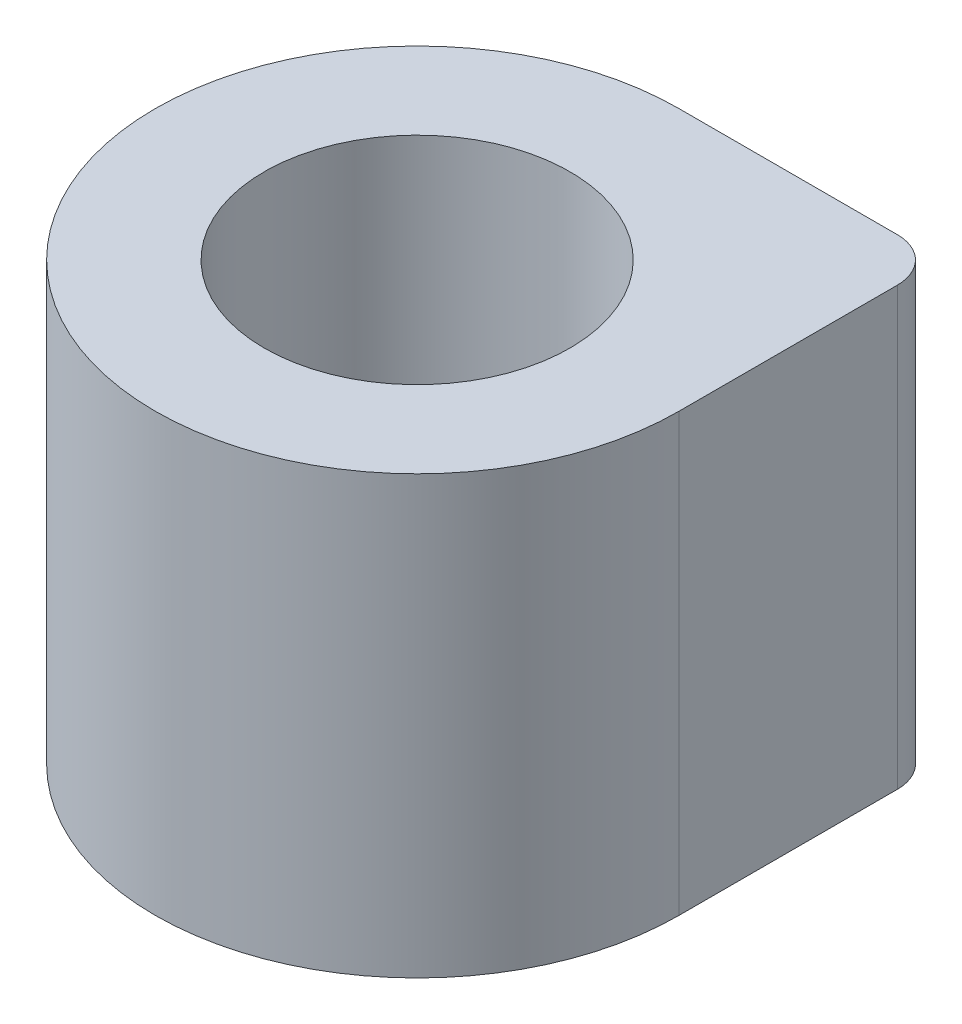
ISO-10303-21;
HEADER;
FILE_DESCRIPTION(('STEP AP214'),'2;1');
FILE_NAME('part.step','',(''),(''),'','','');
FILE_SCHEMA(('AUTOMOTIVE_DESIGN { 1 0 10303 214 1 1 1 1 }'));
ENDSEC;
DATA;
#1=APPLICATION_CONTEXT('core data for automotive mechanical design processes');
#2=APPLICATION_PROTOCOL_DEFINITION('international standard','automotive_design',2000,#1);
#3=PRODUCT_CONTEXT('',#1,'mechanical');
#4=PRODUCT('Part','Part','',(#3));
#5=PRODUCT_RELATED_PRODUCT_CATEGORY('part','',(#4));
#6=PRODUCT_DEFINITION_FORMATION('','',#4);
#7=PRODUCT_DEFINITION_CONTEXT('part definition',#1,'design');
#8=PRODUCT_DEFINITION('design','',#6,#7);
#9=PRODUCT_DEFINITION_SHAPE('','',#8);
#10=(LENGTH_UNIT() NAMED_UNIT(*) SI_UNIT(.MILLI.,.METRE.));
#11=(NAMED_UNIT(*) PLANE_ANGLE_UNIT() SI_UNIT($,.RADIAN.));
#12=(NAMED_UNIT(*) SI_UNIT($,.STERADIAN.) SOLID_ANGLE_UNIT());
#13=UNCERTAINTY_MEASURE_WITH_UNIT(LENGTH_MEASURE(1.E-05),#10,'distance_accuracy_value','');
#14=(GEOMETRIC_REPRESENTATION_CONTEXT(3) GLOBAL_UNCERTAINTY_ASSIGNED_CONTEXT((#13)) GLOBAL_UNIT_ASSIGNED_CONTEXT((#10,
#11,#12)) REPRESENTATION_CONTEXT('',''));
#15=CARTESIAN_POINT('',(0.,0.,0.));
#16=DIRECTION('',(0.,0.,1.));
#17=DIRECTION('',(1.,0.,0.));
#18=AXIS2_PLACEMENT_3D('',#15,#16,#17);
#19=CARTESIAN_POINT('',(0.,10.,0.));
#20=DIRECTION('',(0.,-1.,0.));
#21=DIRECTION('',(0.,0.,-1.));
#22=AXIS2_PLACEMENT_3D('',#19,#20,#21);
#23=CYLINDRICAL_SURFACE('',#22,6.);
#24=CARTESIAN_POINT('',(0.,0.,0.));
#25=DIRECTION('',(0.,1.,0.));
#26=DIRECTION('',(0.,0.,1.));
#27=AXIS2_PLACEMENT_3D('',#24,#25,#26);
#28=CIRCLE('',#27,6.);
#29=CARTESIAN_POINT('',(0.,0.,-6.));
#30=VERTEX_POINT('',#29);
#31=CARTESIAN_POINT('',(6.,0.,0.));
#32=VERTEX_POINT('',#31);
#33=EDGE_CURVE('E90',#30,#32,#28,.T.);
#34=ORIENTED_EDGE('',*,*,#33,.T.);
#35=DIRECTION('',(0.,-1.,0.));
#36=VECTOR('',#35,1.);
#37=CARTESIAN_POINT('',(6.,10.,0.));
#38=LINE('',#37,#36);
#39=CARTESIAN_POINT('',(6.,10.,0.));
#40=VERTEX_POINT('',#39);
#41=EDGE_CURVE('E74',#40,#32,#38,.T.);
#42=ORIENTED_EDGE('',*,*,#41,.F.);
#43=CARTESIAN_POINT('',(0.,10.,0.));
#44=DIRECTION('',(0.,1.,0.));
#45=DIRECTION('',(0.,0.,1.));
#46=AXIS2_PLACEMENT_3D('',#43,#44,#45);
#47=CIRCLE('',#46,6.);
#48=CARTESIAN_POINT('',(0.,10.,-6.));
#49=VERTEX_POINT('',#48);
#50=EDGE_CURVE('E79',#49,#40,#47,.T.);
#51=ORIENTED_EDGE('',*,*,#50,.F.);
#52=DIRECTION('',(0.,-1.,0.));
#53=VECTOR('',#52,1.);
#54=CARTESIAN_POINT('',(0.,10.,-6.));
#55=LINE('',#54,#53);
#56=EDGE_CURVE('E92',#49,#30,#55,.T.);
#57=ORIENTED_EDGE('',*,*,#56,.T.);
#58=EDGE_LOOP('',(#34,#42,#51,#57));
#59=FACE_BOUND('',#58,.T.);
#60=ADVANCED_FACE('F33',(#59),#23,.T.);
#61=CARTESIAN_POINT('',(6.,10.,-6.));
#62=DIRECTION('',(-1.,0.,0.));
#63=DIRECTION('',(0.,0.,1.));
#64=AXIS2_PLACEMENT_3D('',#61,#62,#63);
#65=PLANE('',#64);
#66=DIRECTION('',(0.,0.,-1.));
#67=VECTOR('',#66,1.);
#68=CARTESIAN_POINT('',(6.,0.,-6.));
#69=LINE('',#68,#67);
#70=CARTESIAN_POINT('',(6.,0.,-5.));
#71=VERTEX_POINT('',#70);
#72=EDGE_CURVE('E100',#32,#71,#69,.T.);
#73=ORIENTED_EDGE('',*,*,#72,.T.);
#74=DIRECTION('',(0.,-1.,0.));
#75=VECTOR('',#74,1.);
#76=CARTESIAN_POINT('',(6.,10.,-5.));
#77=LINE('',#76,#75);
#78=CARTESIAN_POINT('',(6.,10.,-5.));
#79=VERTEX_POINT('',#78);
#80=EDGE_CURVE('E41',#71,#79,#77,.F.);
#81=ORIENTED_EDGE('',*,*,#80,.T.);
#82=DIRECTION('',(0.,0.,-1.));
#83=VECTOR('',#82,1.);
#84=CARTESIAN_POINT('',(6.,10.,-6.));
#85=LINE('',#84,#83);
#86=EDGE_CURVE('E70',#40,#79,#85,.T.);
#87=ORIENTED_EDGE('',*,*,#86,.F.);
#88=ORIENTED_EDGE('',*,*,#41,.T.);
#89=EDGE_LOOP('',(#73,#81,#87,#88));
#90=FACE_BOUND('',#89,.T.);
#91=ADVANCED_FACE('F72',(#90),#65,.F.);
#92=CARTESIAN_POINT('',(0.,10.,-6.));
#93=DIRECTION('',(0.,0.,1.));
#94=DIRECTION('',(1.,0.,0.));
#95=AXIS2_PLACEMENT_3D('',#92,#93,#94);
#96=PLANE('',#95);
#97=DIRECTION('',(-1.,0.,0.));
#98=VECTOR('',#97,1.);
#99=CARTESIAN_POINT('',(0.,10.,-6.));
#100=LINE('',#99,#98);
#101=CARTESIAN_POINT('',(5.,10.,-6.));
#102=VERTEX_POINT('',#101);
#103=EDGE_CURVE('E78',#102,#49,#100,.T.);
#104=ORIENTED_EDGE('',*,*,#103,.F.);
#105=DIRECTION('',(0.,-1.,0.));
#106=VECTOR('',#105,1.);
#107=CARTESIAN_POINT('',(5.,10.,-6.));
#108=LINE('',#107,#106);
#109=CARTESIAN_POINT('',(5.,0.,-6.));
#110=VERTEX_POINT('',#109);
#111=EDGE_CURVE('E91',#102,#110,#108,.T.);
#112=ORIENTED_EDGE('',*,*,#111,.T.);
#113=DIRECTION('',(-1.,0.,0.));
#114=VECTOR('',#113,1.);
#115=CARTESIAN_POINT('',(0.,0.,-6.));
#116=LINE('',#115,#114);
#117=EDGE_CURVE('E87',#110,#30,#116,.T.);
#118=ORIENTED_EDGE('',*,*,#117,.T.);
#119=ORIENTED_EDGE('',*,*,#56,.F.);
#120=EDGE_LOOP('',(#104,#112,#118,#119));
#121=FACE_BOUND('',#120,.T.);
#122=ADVANCED_FACE('F121',(#121),#96,.F.);
#123=CARTESIAN_POINT('',(0.,10.,0.));
#124=DIRECTION('',(0.,1.,0.));
#125=DIRECTION('',(0.,0.,1.));
#126=AXIS2_PLACEMENT_3D('',#123,#124,#125);
#127=PLANE('',#126);
#128=CARTESIAN_POINT('',(0.,10.,0.));
#129=DIRECTION('',(0.,1.,0.));
#130=DIRECTION('',(0.,0.,1.));
#131=AXIS2_PLACEMENT_3D('',#128,#129,#130);
#132=CIRCLE('',#131,3.5);
#133=CARTESIAN_POINT('',(0.,10.,3.5));
#134=VERTEX_POINT('',#133);
#135=EDGE_CURVE('E105',#134,#134,#132,.T.);
#136=ORIENTED_EDGE('',*,*,#135,.F.);
#137=EDGE_LOOP('',(#136));
#138=FACE_BOUND('',#137,.T.);
#139=ORIENTED_EDGE('',*,*,#86,.T.);
#140=CARTESIAN_POINT('',(5.,10.,-5.));
#141=DIRECTION('',(0.,1.,0.));
#142=DIRECTION('',(0.,0.,1.));
#143=AXIS2_PLACEMENT_3D('',#140,#141,#142);
#144=CIRCLE('',#143,1.);
#145=EDGE_CURVE('E11',#79,#102,#144,.T.);
#146=ORIENTED_EDGE('',*,*,#145,.T.);
#147=ORIENTED_EDGE('',*,*,#103,.T.);
#148=ORIENTED_EDGE('',*,*,#50,.T.);
#149=EDGE_LOOP('',(#139,#146,#147,#148));
#150=FACE_BOUND('',#149,.T.);
#151=ADVANCED_FACE('F82',(#138,#150),#127,.T.);
#152=CARTESIAN_POINT('',(0.,0.,0.));
#153=DIRECTION('',(0.,1.,0.));
#154=DIRECTION('',(0.,0.,1.));
#155=AXIS2_PLACEMENT_3D('',#152,#153,#154);
#156=PLANE('',#155);
#157=ORIENTED_EDGE('',*,*,#117,.F.);
#158=CARTESIAN_POINT('',(5.,0.,-5.));
#159=DIRECTION('',(0.,1.,0.));
#160=DIRECTION('',(0.,0.,1.));
#161=AXIS2_PLACEMENT_3D('',#158,#159,#160);
#162=CIRCLE('',#161,1.);
#163=EDGE_CURVE('E55',#110,#71,#162,.F.);
#164=ORIENTED_EDGE('',*,*,#163,.T.);
#165=ORIENTED_EDGE('',*,*,#72,.F.);
#166=ORIENTED_EDGE('',*,*,#33,.F.);
#167=EDGE_LOOP('',(#157,#164,#165,#166));
#168=FACE_BOUND('',#167,.T.);
#169=ADVANCED_FACE('F116',(#168),#156,.F.);
#170=CARTESIAN_POINT('',(0.,2.,0.));
#171=DIRECTION('',(0.,1.,0.));
#172=DIRECTION('',(0.,0.,1.));
#173=AXIS2_PLACEMENT_3D('',#170,#171,#172);
#174=CYLINDRICAL_SURFACE('',#173,3.5);
#175=CARTESIAN_POINT('',(0.,2.,0.));
#176=DIRECTION('',(0.,1.,0.));
#177=DIRECTION('',(0.,0.,1.));
#178=AXIS2_PLACEMENT_3D('',#175,#176,#177);
#179=CIRCLE('',#178,3.5);
#180=CARTESIAN_POINT('',(0.,2.,3.5));
#181=VERTEX_POINT('',#180);
#182=EDGE_CURVE('E103',#181,#181,#179,.T.);
#183=ORIENTED_EDGE('',*,*,#182,.F.);
#184=EDGE_LOOP('',(#183));
#185=FACE_BOUND('',#184,.T.);
#186=ORIENTED_EDGE('',*,*,#135,.T.);
#187=EDGE_LOOP('',(#186));
#188=FACE_BOUND('',#187,.T.);
#189=ADVANCED_FACE('F113',(#185,#188),#174,.F.);
#190=CARTESIAN_POINT('',(0.,2.,0.));
#191=DIRECTION('',(0.,1.,0.));
#192=DIRECTION('',(0.,0.,1.));
#193=AXIS2_PLACEMENT_3D('',#190,#191,#192);
#194=PLANE('',#193);
#195=ORIENTED_EDGE('',*,*,#182,.T.);
#196=EDGE_LOOP('',(#195));
#197=FACE_BOUND('',#196,.T.);
#198=ADVANCED_FACE('F111',(#197),#194,.T.);
#199=CARTESIAN_POINT('',(5.,10.,-5.));
#200=DIRECTION('',(0.,-1.,0.));
#201=DIRECTION('',(0.,0.,-1.));
#202=AXIS2_PLACEMENT_3D('',#199,#200,#201);
#203=CYLINDRICAL_SURFACE('',#202,1.);
#204=ORIENTED_EDGE('',*,*,#145,.F.);
#205=ORIENTED_EDGE('',*,*,#80,.F.);
#206=ORIENTED_EDGE('',*,*,#163,.F.);
#207=ORIENTED_EDGE('',*,*,#111,.F.);
#208=EDGE_LOOP('',(#204,#205,#206,#207));
#209=FACE_BOUND('',#208,.T.);
#210=ADVANCED_FACE('F35',(#209),#203,.T.);
#211=CLOSED_SHELL('',(#60,#91,#122,#151,#169,#189,#198,#210));
#212=MANIFOLD_SOLID_BREP('B2',#211);
#213=ADVANCED_BREP_SHAPE_REPRESENTATION('',(#18,#212),#14);
#214=SHAPE_DEFINITION_REPRESENTATION(#9,#213);
ENDSEC;
END-ISO-10303-21;
